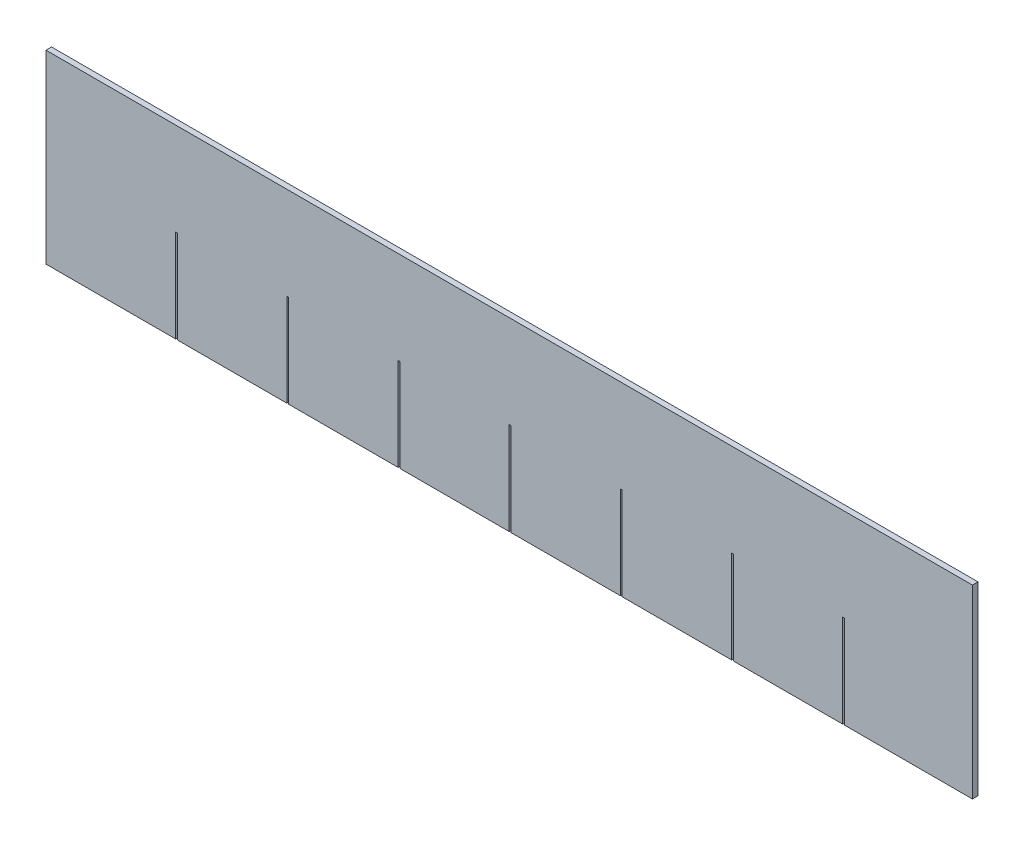
ISO-10303-21;
HEADER;
FILE_DESCRIPTION(('STEP AP214'),'2;1');
FILE_NAME('part.step','',(''),(''),'','','');
FILE_SCHEMA(('AUTOMOTIVE_DESIGN { 1 0 10303 214 1 1 1 1 }'));
ENDSEC;
DATA;
#1=APPLICATION_CONTEXT('core data for automotive mechanical design processes');
#2=APPLICATION_PROTOCOL_DEFINITION('international standard','automotive_design',2000,#1);
#3=PRODUCT_CONTEXT('',#1,'mechanical');
#4=PRODUCT('Part','Part','',(#3));
#5=PRODUCT_RELATED_PRODUCT_CATEGORY('part','',(#4));
#6=PRODUCT_DEFINITION_FORMATION('','',#4);
#7=PRODUCT_DEFINITION_CONTEXT('part definition',#1,'design');
#8=PRODUCT_DEFINITION('design','',#6,#7);
#9=PRODUCT_DEFINITION_SHAPE('','',#8);
#10=(LENGTH_UNIT() NAMED_UNIT(*) SI_UNIT(.MILLI.,.METRE.));
#11=(NAMED_UNIT(*) PLANE_ANGLE_UNIT() SI_UNIT($,.RADIAN.));
#12=(NAMED_UNIT(*) SI_UNIT($,.STERADIAN.) SOLID_ANGLE_UNIT());
#13=UNCERTAINTY_MEASURE_WITH_UNIT(LENGTH_MEASURE(1.E-05),#10,'distance_accuracy_value','');
#14=(GEOMETRIC_REPRESENTATION_CONTEXT(3) GLOBAL_UNCERTAINTY_ASSIGNED_CONTEXT((#13)) GLOBAL_UNIT_ASSIGNED_CONTEXT((#10,
#11,#12)) REPRESENTATION_CONTEXT('',''));
#15=CARTESIAN_POINT('',(0.,0.,0.));
#16=DIRECTION('',(0.,0.,1.));
#17=DIRECTION('',(1.,0.,0.));
#18=AXIS2_PLACEMENT_3D('',#15,#16,#17);
#19=CARTESIAN_POINT('',(-31.75,-6.35,0.381));
#20=DIRECTION('',(0.,1.,0.));
#21=DIRECTION('',(0.,0.,1.));
#22=AXIS2_PLACEMENT_3D('',#19,#20,#21);
#23=PLANE('',#22);
#24=DIRECTION('',(1.,0.,0.));
#25=VECTOR('',#24,1.);
#26=CARTESIAN_POINT('',(-31.75,-6.35,0.));
#27=LINE('',#26,#25);
#28=CARTESIAN_POINT('',(-31.75,-6.35,0.));
#29=VERTEX_POINT('',#28);
#30=CARTESIAN_POINT('',(-22.86,-6.35,0.));
#31=VERTEX_POINT('',#30);
#32=EDGE_CURVE('E258',#29,#31,#27,.T.);
#33=ORIENTED_EDGE('',*,*,#32,.T.);
#34=DIRECTION('',(0.,0.,1.));
#35=VECTOR('',#34,1.);
#36=CARTESIAN_POINT('',(-22.86,-6.35,0.));
#37=LINE('',#36,#35);
#38=CARTESIAN_POINT('',(-22.86,-6.35,0.381));
#39=VERTEX_POINT('',#38);
#40=EDGE_CURVE('E242',#31,#39,#37,.T.);
#41=ORIENTED_EDGE('',*,*,#40,.T.);
#42=DIRECTION('',(1.,0.,0.));
#43=VECTOR('',#42,1.);
#44=CARTESIAN_POINT('',(-31.75,-6.35,0.381));
#45=LINE('',#44,#43);
#46=CARTESIAN_POINT('',(-31.75,-6.35,0.381));
#47=VERTEX_POINT('',#46);
#48=EDGE_CURVE('E295',#47,#39,#45,.T.);
#49=ORIENTED_EDGE('',*,*,#48,.F.);
#50=DIRECTION('',(0.,0.,-1.));
#51=VECTOR('',#50,1.);
#52=CARTESIAN_POINT('',(-31.75,-6.35,0.381));
#53=LINE('',#52,#51);
#54=EDGE_CURVE('E265',#47,#29,#53,.T.);
#55=ORIENTED_EDGE('',*,*,#54,.T.);
#56=EDGE_LOOP('',(#33,#41,#49,#55));
#57=FACE_BOUND('',#56,.T.);
#58=ADVANCED_FACE('F33',(#57),#23,.F.);
#59=CARTESIAN_POINT('',(-22.733,-6.35,0.381));
#60=VERTEX_POINT('',#59);
#61=CARTESIAN_POINT('',(-15.24,-6.35,0.381));
#62=VERTEX_POINT('',#61);
#63=EDGE_CURVE('E298',#60,#62,#45,.T.);
#64=ORIENTED_EDGE('',*,*,#63,.F.);
#65=DIRECTION('',(0.,0.,1.));
#66=VECTOR('',#65,1.);
#67=CARTESIAN_POINT('',(-22.733,-6.35,0.));
#68=LINE('',#67,#66);
#69=CARTESIAN_POINT('',(-22.733,-6.35,0.));
#70=VERTEX_POINT('',#69);
#71=EDGE_CURVE('E252',#70,#60,#68,.T.);
#72=ORIENTED_EDGE('',*,*,#71,.F.);
#73=CARTESIAN_POINT('',(-15.24,-6.35,0.));
#74=VERTEX_POINT('',#73);
#75=EDGE_CURVE('E267',#70,#74,#27,.T.);
#76=ORIENTED_EDGE('',*,*,#75,.T.);
#77=DIRECTION('',(0.,0.,1.));
#78=VECTOR('',#77,1.);
#79=CARTESIAN_POINT('',(-15.24,-6.35,0.));
#80=LINE('',#79,#78);
#81=EDGE_CURVE('E441',#74,#62,#80,.T.);
#82=ORIENTED_EDGE('',*,*,#81,.T.);
#83=EDGE_LOOP('',(#64,#72,#76,#82));
#84=FACE_BOUND('',#83,.T.);
#85=ADVANCED_FACE('F475',(#84),#23,.F.);
#86=CARTESIAN_POINT('',(-15.113,-6.35,0.381));
#87=VERTEX_POINT('',#86);
#88=CARTESIAN_POINT('',(-7.62,-6.35,0.381));
#89=VERTEX_POINT('',#88);
#90=EDGE_CURVE('E479',#87,#89,#45,.T.);
#91=ORIENTED_EDGE('',*,*,#90,.F.);
#92=DIRECTION('',(0.,0.,1.));
#93=VECTOR('',#92,1.);
#94=CARTESIAN_POINT('',(-15.113,-6.35,0.));
#95=LINE('',#94,#93);
#96=CARTESIAN_POINT('',(-15.113,-6.35,0.));
#97=VERTEX_POINT('',#96);
#98=EDGE_CURVE('E434',#97,#87,#95,.T.);
#99=ORIENTED_EDGE('',*,*,#98,.F.);
#100=CARTESIAN_POINT('',(-7.62,-6.35,0.));
#101=VERTEX_POINT('',#100);
#102=EDGE_CURVE('E274',#97,#101,#27,.T.);
#103=ORIENTED_EDGE('',*,*,#102,.T.);
#104=DIRECTION('',(0.,0.,1.));
#105=VECTOR('',#104,1.);
#106=CARTESIAN_POINT('',(-7.62,-6.35,0.));
#107=LINE('',#106,#105);
#108=EDGE_CURVE('E415',#101,#89,#107,.T.);
#109=ORIENTED_EDGE('',*,*,#108,.T.);
#110=EDGE_LOOP('',(#91,#99,#103,#109));
#111=FACE_BOUND('',#110,.T.);
#112=ADVANCED_FACE('F558',(#111),#23,.F.);
#113=CARTESIAN_POINT('',(-7.493,-6.35,0.381));
#114=VERTEX_POINT('',#113);
#115=CARTESIAN_POINT('',(0.,-6.35,0.381));
#116=VERTEX_POINT('',#115);
#117=EDGE_CURVE('E481',#114,#116,#45,.T.);
#118=ORIENTED_EDGE('',*,*,#117,.F.);
#119=DIRECTION('',(0.,0.,1.));
#120=VECTOR('',#119,1.);
#121=CARTESIAN_POINT('',(-7.493,-6.35,0.));
#122=LINE('',#121,#120);
#123=CARTESIAN_POINT('',(-7.493,-6.35,0.));
#124=VERTEX_POINT('',#123);
#125=EDGE_CURVE('E408',#124,#114,#122,.T.);
#126=ORIENTED_EDGE('',*,*,#125,.F.);
#127=CARTESIAN_POINT('',(0.,-6.35,0.));
#128=VERTEX_POINT('',#127);
#129=EDGE_CURVE('E546',#124,#128,#27,.T.);
#130=ORIENTED_EDGE('',*,*,#129,.T.);
#131=DIRECTION('',(0.,0.,1.));
#132=VECTOR('',#131,1.);
#133=CARTESIAN_POINT('',(0.,-6.35,0.));
#134=LINE('',#133,#132);
#135=EDGE_CURVE('E389',#128,#116,#134,.T.);
#136=ORIENTED_EDGE('',*,*,#135,.T.);
#137=EDGE_LOOP('',(#118,#126,#130,#136));
#138=FACE_BOUND('',#137,.T.);
#139=ADVANCED_FACE('F568',(#138),#23,.F.);
#140=CARTESIAN_POINT('',(0.126999999999995,-6.35,0.381));
#141=VERTEX_POINT('',#140);
#142=CARTESIAN_POINT('',(7.61999999999999,-6.35,0.381));
#143=VERTEX_POINT('',#142);
#144=EDGE_CURVE('E486',#141,#143,#45,.T.);
#145=ORIENTED_EDGE('',*,*,#144,.F.);
#146=DIRECTION('',(0.,0.,1.));
#147=VECTOR('',#146,1.);
#148=CARTESIAN_POINT('',(0.126999999999995,-6.35,0.));
#149=LINE('',#148,#147);
#150=CARTESIAN_POINT('',(0.126999999999995,-6.35,0.));
#151=VERTEX_POINT('',#150);
#152=EDGE_CURVE('E382',#151,#141,#149,.T.);
#153=ORIENTED_EDGE('',*,*,#152,.F.);
#154=CARTESIAN_POINT('',(7.61999999999999,-6.35,0.));
#155=VERTEX_POINT('',#154);
#156=EDGE_CURVE('E544',#151,#155,#27,.T.);
#157=ORIENTED_EDGE('',*,*,#156,.T.);
#158=DIRECTION('',(0.,0.,1.));
#159=VECTOR('',#158,1.);
#160=CARTESIAN_POINT('',(7.61999999999999,-6.35,0.));
#161=LINE('',#160,#159);
#162=EDGE_CURVE('E363',#155,#143,#161,.T.);
#163=ORIENTED_EDGE('',*,*,#162,.T.);
#164=EDGE_LOOP('',(#145,#153,#157,#163));
#165=FACE_BOUND('',#164,.T.);
#166=ADVANCED_FACE('F578',(#165),#23,.F.);
#167=CARTESIAN_POINT('',(7.74699999999999,-6.35,0.381));
#168=VERTEX_POINT('',#167);
#169=CARTESIAN_POINT('',(15.24,-6.35,0.381));
#170=VERTEX_POINT('',#169);
#171=EDGE_CURVE('E491',#168,#170,#45,.T.);
#172=ORIENTED_EDGE('',*,*,#171,.F.);
#173=DIRECTION('',(0.,0.,1.));
#174=VECTOR('',#173,1.);
#175=CARTESIAN_POINT('',(7.74699999999999,-6.35,0.));
#176=LINE('',#175,#174);
#177=CARTESIAN_POINT('',(7.74699999999999,-6.35,0.));
#178=VERTEX_POINT('',#177);
#179=EDGE_CURVE('E356',#178,#168,#176,.T.);
#180=ORIENTED_EDGE('',*,*,#179,.F.);
#181=CARTESIAN_POINT('',(15.24,-6.35,0.));
#182=VERTEX_POINT('',#181);
#183=EDGE_CURVE('E285',#178,#182,#27,.T.);
#184=ORIENTED_EDGE('',*,*,#183,.T.);
#185=DIRECTION('',(0.,0.,1.));
#186=VECTOR('',#185,1.);
#187=CARTESIAN_POINT('',(15.24,-6.35,0.));
#188=LINE('',#187,#186);
#189=EDGE_CURVE('E337',#182,#170,#188,.T.);
#190=ORIENTED_EDGE('',*,*,#189,.T.);
#191=EDGE_LOOP('',(#172,#180,#184,#190));
#192=FACE_BOUND('',#191,.T.);
#193=ADVANCED_FACE('F543',(#192),#23,.F.);
#194=CARTESIAN_POINT('',(15.367,-6.35,0.381));
#195=VERTEX_POINT('',#194);
#196=CARTESIAN_POINT('',(22.86,-6.35,0.381));
#197=VERTEX_POINT('',#196);
#198=EDGE_CURVE('E496',#195,#197,#45,.T.);
#199=ORIENTED_EDGE('',*,*,#198,.F.);
#200=DIRECTION('',(0.,0.,1.));
#201=VECTOR('',#200,1.);
#202=CARTESIAN_POINT('',(15.367,-6.35,0.));
#203=LINE('',#202,#201);
#204=CARTESIAN_POINT('',(15.367,-6.35,0.));
#205=VERTEX_POINT('',#204);
#206=EDGE_CURVE('E330',#205,#195,#203,.T.);
#207=ORIENTED_EDGE('',*,*,#206,.F.);
#208=CARTESIAN_POINT('',(22.86,-6.35,0.));
#209=VERTEX_POINT('',#208);
#210=EDGE_CURVE('E277',#205,#209,#27,.T.);
#211=ORIENTED_EDGE('',*,*,#210,.T.);
#212=DIRECTION('',(0.,0.,1.));
#213=VECTOR('',#212,1.);
#214=CARTESIAN_POINT('',(22.86,-6.35,0.));
#215=LINE('',#214,#213);
#216=EDGE_CURVE('E310',#209,#197,#215,.T.);
#217=ORIENTED_EDGE('',*,*,#216,.T.);
#218=EDGE_LOOP('',(#199,#207,#211,#217));
#219=FACE_BOUND('',#218,.T.);
#220=ADVANCED_FACE('F530',(#219),#23,.F.);
#221=CARTESIAN_POINT('',(31.75,6.35,0.381));
#222=DIRECTION('',(-1.,0.,0.));
#223=DIRECTION('',(0.,0.,1.));
#224=AXIS2_PLACEMENT_3D('',#221,#222,#223);
#225=PLANE('',#224);
#226=DIRECTION('',(0.,1.,0.));
#227=VECTOR('',#226,1.);
#228=CARTESIAN_POINT('',(31.75,6.35,0.));
#229=LINE('',#228,#227);
#230=CARTESIAN_POINT('',(31.75,-6.35,0.));
#231=VERTEX_POINT('',#230);
#232=CARTESIAN_POINT('',(31.75,6.35,0.));
#233=VERTEX_POINT('',#232);
#234=EDGE_CURVE('E289',#231,#233,#229,.T.);
#235=ORIENTED_EDGE('',*,*,#234,.T.);
#236=DIRECTION('',(0.,0.,-1.));
#237=VECTOR('',#236,1.);
#238=CARTESIAN_POINT('',(31.75,6.35,0.381));
#239=LINE('',#238,#237);
#240=CARTESIAN_POINT('',(31.75,6.35,0.381));
#241=VERTEX_POINT('',#240);
#242=EDGE_CURVE('E11',#241,#233,#239,.T.);
#243=ORIENTED_EDGE('',*,*,#242,.F.);
#244=DIRECTION('',(0.,1.,0.));
#245=VECTOR('',#244,1.);
#246=CARTESIAN_POINT('',(31.75,6.35,0.381));
#247=LINE('',#246,#245);
#248=CARTESIAN_POINT('',(31.75,-6.35,0.381));
#249=VERTEX_POINT('',#248);
#250=EDGE_CURVE('E266',#249,#241,#247,.T.);
#251=ORIENTED_EDGE('',*,*,#250,.F.);
#252=DIRECTION('',(0.,0.,-1.));
#253=VECTOR('',#252,1.);
#254=CARTESIAN_POINT('',(31.75,-6.35,0.381));
#255=LINE('',#254,#253);
#256=EDGE_CURVE('E297',#249,#231,#255,.T.);
#257=ORIENTED_EDGE('',*,*,#256,.T.);
#258=EDGE_LOOP('',(#235,#243,#251,#257));
#259=FACE_BOUND('',#258,.T.);
#260=ADVANCED_FACE('F35',(#259),#225,.F.);
#261=CARTESIAN_POINT('',(-31.75,6.35,0.381));
#262=DIRECTION('',(0.,-1.,0.));
#263=DIRECTION('',(0.,0.,-1.));
#264=AXIS2_PLACEMENT_3D('',#261,#262,#263);
#265=PLANE('',#264);
#266=DIRECTION('',(-1.,0.,0.));
#267=VECTOR('',#266,1.);
#268=CARTESIAN_POINT('',(-31.75,6.35,0.));
#269=LINE('',#268,#267);
#270=CARTESIAN_POINT('',(-31.75,6.35,0.));
#271=VERTEX_POINT('',#270);
#272=EDGE_CURVE('E286',#233,#271,#269,.T.);
#273=ORIENTED_EDGE('',*,*,#272,.T.);
#274=DIRECTION('',(0.,0.,-1.));
#275=VECTOR('',#274,1.);
#276=CARTESIAN_POINT('',(-31.75,6.35,0.381));
#277=LINE('',#276,#275);
#278=CARTESIAN_POINT('',(-31.75,6.35,0.381));
#279=VERTEX_POINT('',#278);
#280=EDGE_CURVE('E41',#279,#271,#277,.T.);
#281=ORIENTED_EDGE('',*,*,#280,.F.);
#282=DIRECTION('',(-1.,0.,0.));
#283=VECTOR('',#282,1.);
#284=CARTESIAN_POINT('',(-31.75,6.35,0.381));
#285=LINE('',#284,#283);
#286=EDGE_CURVE('E271',#241,#279,#285,.T.);
#287=ORIENTED_EDGE('',*,*,#286,.F.);
#288=ORIENTED_EDGE('',*,*,#242,.T.);
#289=EDGE_LOOP('',(#273,#281,#287,#288));
#290=FACE_BOUND('',#289,.T.);
#291=ADVANCED_FACE('F514',(#290),#265,.F.);
#292=CARTESIAN_POINT('',(-31.75,6.35,0.381));
#293=DIRECTION('',(1.,0.,0.));
#294=DIRECTION('',(0.,0.,-1.));
#295=AXIS2_PLACEMENT_3D('',#292,#293,#294);
#296=PLANE('',#295);
#297=DIRECTION('',(0.,-1.,0.));
#298=VECTOR('',#297,1.);
#299=CARTESIAN_POINT('',(-31.75,6.35,0.));
#300=LINE('',#299,#298);
#301=EDGE_CURVE('E278',#271,#29,#300,.T.);
#302=ORIENTED_EDGE('',*,*,#301,.T.);
#303=ORIENTED_EDGE('',*,*,#54,.F.);
#304=DIRECTION('',(0.,-1.,0.));
#305=VECTOR('',#304,1.);
#306=CARTESIAN_POINT('',(-31.75,6.35,0.381));
#307=LINE('',#306,#305);
#308=EDGE_CURVE('E300',#279,#47,#307,.T.);
#309=ORIENTED_EDGE('',*,*,#308,.F.);
#310=ORIENTED_EDGE('',*,*,#280,.T.);
#311=EDGE_LOOP('',(#302,#303,#309,#310));
#312=FACE_BOUND('',#311,.T.);
#313=ADVANCED_FACE('F517',(#312),#296,.F.);
#314=CARTESIAN_POINT('',(22.987,-6.35,0.381));
#315=VERTEX_POINT('',#314);
#316=EDGE_CURVE('E299',#315,#249,#45,.T.);
#317=ORIENTED_EDGE('',*,*,#316,.F.);
#318=DIRECTION('',(0.,0.,1.));
#319=VECTOR('',#318,1.);
#320=CARTESIAN_POINT('',(22.987,-6.35,0.));
#321=LINE('',#320,#319);
#322=CARTESIAN_POINT('',(22.987,-6.35,0.));
#323=VERTEX_POINT('',#322);
#324=EDGE_CURVE('E303',#323,#315,#321,.T.);
#325=ORIENTED_EDGE('',*,*,#324,.F.);
#326=EDGE_CURVE('E269',#323,#231,#27,.T.);
#327=ORIENTED_EDGE('',*,*,#326,.T.);
#328=ORIENTED_EDGE('',*,*,#256,.F.);
#329=EDGE_LOOP('',(#317,#325,#327,#328));
#330=FACE_BOUND('',#329,.T.);
#331=ADVANCED_FACE('F510',(#330),#23,.F.);
#332=CARTESIAN_POINT('',(0.,0.,0.381));
#333=DIRECTION('',(0.,0.,1.));
#334=DIRECTION('',(1.,0.,0.));
#335=AXIS2_PLACEMENT_3D('',#332,#333,#334);
#336=PLANE('',#335);
#337=DIRECTION('',(0.,-1.,0.));
#338=VECTOR('',#337,1.);
#339=CARTESIAN_POINT('',(-22.86,-6.35,0.381));
#340=LINE('',#339,#338);
#341=CARTESIAN_POINT('',(-22.86,0.,0.381));
#342=VERTEX_POINT('',#341);
#343=EDGE_CURVE('E247',#342,#39,#340,.T.);
#344=ORIENTED_EDGE('',*,*,#343,.F.);
#345=DIRECTION('',(-1.,0.,0.));
#346=VECTOR('',#345,1.);
#347=CARTESIAN_POINT('',(-22.86,0.,0.381));
#348=LINE('',#347,#346);
#349=CARTESIAN_POINT('',(-22.733,0.,0.381));
#350=VERTEX_POINT('',#349);
#351=EDGE_CURVE('E261',#350,#342,#348,.T.);
#352=ORIENTED_EDGE('',*,*,#351,.F.);
#353=DIRECTION('',(0.,1.,0.));
#354=VECTOR('',#353,1.);
#355=CARTESIAN_POINT('',(-22.733,-6.35,0.381));
#356=LINE('',#355,#354);
#357=EDGE_CURVE('E463',#60,#350,#356,.T.);
#358=ORIENTED_EDGE('',*,*,#357,.F.);
#359=ORIENTED_EDGE('',*,*,#63,.T.);
#360=DIRECTION('',(0.,-1.,0.));
#361=VECTOR('',#360,1.);
#362=CARTESIAN_POINT('',(-15.24,-6.35,0.381));
#363=LINE('',#362,#361);
#364=CARTESIAN_POINT('',(-15.24,0.,0.381));
#365=VERTEX_POINT('',#364);
#366=EDGE_CURVE('E444',#365,#62,#363,.T.);
#367=ORIENTED_EDGE('',*,*,#366,.F.);
#368=DIRECTION('',(-1.,0.,0.));
#369=VECTOR('',#368,1.);
#370=CARTESIAN_POINT('',(-15.24,0.,0.381));
#371=LINE('',#370,#369);
#372=CARTESIAN_POINT('',(-15.113,0.,0.381));
#373=VERTEX_POINT('',#372);
#374=EDGE_CURVE('E447',#373,#365,#371,.T.);
#375=ORIENTED_EDGE('',*,*,#374,.F.);
#376=DIRECTION('',(0.,1.,0.));
#377=VECTOR('',#376,1.);
#378=CARTESIAN_POINT('',(-15.113,-6.35,0.381));
#379=LINE('',#378,#377);
#380=EDGE_CURVE('E418',#87,#373,#379,.T.);
#381=ORIENTED_EDGE('',*,*,#380,.F.);
#382=ORIENTED_EDGE('',*,*,#90,.T.);
#383=DIRECTION('',(0.,-1.,0.));
#384=VECTOR('',#383,1.);
#385=CARTESIAN_POINT('',(-7.62,-6.35,0.381));
#386=LINE('',#385,#384);
#387=CARTESIAN_POINT('',(-7.62,0.,0.381));
#388=VERTEX_POINT('',#387);
#389=EDGE_CURVE('E419',#388,#89,#386,.T.);
#390=ORIENTED_EDGE('',*,*,#389,.F.);
#391=DIRECTION('',(-1.,0.,0.));
#392=VECTOR('',#391,1.);
#393=CARTESIAN_POINT('',(-7.62,0.,0.381));
#394=LINE('',#393,#392);
#395=CARTESIAN_POINT('',(-7.493,0.,0.381));
#396=VERTEX_POINT('',#395);
#397=EDGE_CURVE('E422',#396,#388,#394,.T.);
#398=ORIENTED_EDGE('',*,*,#397,.F.);
#399=DIRECTION('',(0.,1.,0.));
#400=VECTOR('',#399,1.);
#401=CARTESIAN_POINT('',(-7.493,-6.35,0.381));
#402=LINE('',#401,#400);
#403=EDGE_CURVE('E392',#114,#396,#402,.T.);
#404=ORIENTED_EDGE('',*,*,#403,.F.);
#405=ORIENTED_EDGE('',*,*,#117,.T.);
#406=DIRECTION('',(0.,-1.,0.));
#407=VECTOR('',#406,1.);
#408=CARTESIAN_POINT('',(0.,-6.35,0.381));
#409=LINE('',#408,#407);
#410=CARTESIAN_POINT('',(0.,0.,0.381));
#411=VERTEX_POINT('',#410);
#412=EDGE_CURVE('E393',#411,#116,#409,.T.);
#413=ORIENTED_EDGE('',*,*,#412,.F.);
#414=DIRECTION('',(-1.,0.,0.));
#415=VECTOR('',#414,1.);
#416=CARTESIAN_POINT('',(0.,0.,0.381));
#417=LINE('',#416,#415);
#418=CARTESIAN_POINT('',(0.126999999999995,0.,0.381));
#419=VERTEX_POINT('',#418);
#420=EDGE_CURVE('E396',#419,#411,#417,.T.);
#421=ORIENTED_EDGE('',*,*,#420,.F.);
#422=DIRECTION('',(0.,1.,0.));
#423=VECTOR('',#422,1.);
#424=CARTESIAN_POINT('',(0.126999999999995,-6.35,0.381));
#425=LINE('',#424,#423);
#426=EDGE_CURVE('E366',#141,#419,#425,.T.);
#427=ORIENTED_EDGE('',*,*,#426,.F.);
#428=ORIENTED_EDGE('',*,*,#144,.T.);
#429=DIRECTION('',(0.,-1.,0.));
#430=VECTOR('',#429,1.);
#431=CARTESIAN_POINT('',(7.61999999999999,-6.35,0.381));
#432=LINE('',#431,#430);
#433=CARTESIAN_POINT('',(7.61999999999999,0.,0.381));
#434=VERTEX_POINT('',#433);
#435=EDGE_CURVE('E367',#434,#143,#432,.T.);
#436=ORIENTED_EDGE('',*,*,#435,.F.);
#437=DIRECTION('',(-1.,0.,0.));
#438=VECTOR('',#437,1.);
#439=CARTESIAN_POINT('',(7.61999999999999,0.,0.381));
#440=LINE('',#439,#438);
#441=CARTESIAN_POINT('',(7.74699999999999,0.,0.381));
#442=VERTEX_POINT('',#441);
#443=EDGE_CURVE('E370',#442,#434,#440,.T.);
#444=ORIENTED_EDGE('',*,*,#443,.F.);
#445=DIRECTION('',(0.,1.,0.));
#446=VECTOR('',#445,1.);
#447=CARTESIAN_POINT('',(7.74699999999999,-6.35,0.381));
#448=LINE('',#447,#446);
#449=EDGE_CURVE('E340',#168,#442,#448,.T.);
#450=ORIENTED_EDGE('',*,*,#449,.F.);
#451=ORIENTED_EDGE('',*,*,#171,.T.);
#452=DIRECTION('',(0.,-1.,0.));
#453=VECTOR('',#452,1.);
#454=CARTESIAN_POINT('',(15.24,-6.35,0.381));
#455=LINE('',#454,#453);
#456=CARTESIAN_POINT('',(15.24,0.,0.381));
#457=VERTEX_POINT('',#456);
#458=EDGE_CURVE('E341',#457,#170,#455,.T.);
#459=ORIENTED_EDGE('',*,*,#458,.F.);
#460=DIRECTION('',(-1.,0.,0.));
#461=VECTOR('',#460,1.);
#462=CARTESIAN_POINT('',(15.24,0.,0.381));
#463=LINE('',#462,#461);
#464=CARTESIAN_POINT('',(15.367,0.,0.381));
#465=VERTEX_POINT('',#464);
#466=EDGE_CURVE('E344',#465,#457,#463,.T.);
#467=ORIENTED_EDGE('',*,*,#466,.F.);
#468=DIRECTION('',(0.,1.,0.));
#469=VECTOR('',#468,1.);
#470=CARTESIAN_POINT('',(15.367,-6.35,0.381));
#471=LINE('',#470,#469);
#472=EDGE_CURVE('E313',#195,#465,#471,.T.);
#473=ORIENTED_EDGE('',*,*,#472,.F.);
#474=ORIENTED_EDGE('',*,*,#198,.T.);
#475=DIRECTION('',(0.,-1.,0.));
#476=VECTOR('',#475,1.);
#477=CARTESIAN_POINT('',(22.86,-6.35,0.381));
#478=LINE('',#477,#476);
#479=CARTESIAN_POINT('',(22.86,0.,0.381));
#480=VERTEX_POINT('',#479);
#481=EDGE_CURVE('E314',#480,#197,#478,.T.);
#482=ORIENTED_EDGE('',*,*,#481,.F.);
#483=DIRECTION('',(-1.,0.,0.));
#484=VECTOR('',#483,1.);
#485=CARTESIAN_POINT('',(22.86,0.,0.381));
#486=LINE('',#485,#484);
#487=CARTESIAN_POINT('',(22.987,0.,0.381));
#488=VERTEX_POINT('',#487);
#489=EDGE_CURVE('E317',#488,#480,#486,.T.);
#490=ORIENTED_EDGE('',*,*,#489,.F.);
#491=DIRECTION('',(0.,1.,0.));
#492=VECTOR('',#491,1.);
#493=CARTESIAN_POINT('',(22.987,-6.35,0.381));
#494=LINE('',#493,#492);
#495=EDGE_CURVE('E320',#315,#488,#494,.T.);
#496=ORIENTED_EDGE('',*,*,#495,.F.);
#497=ORIENTED_EDGE('',*,*,#316,.T.);
#498=ORIENTED_EDGE('',*,*,#250,.T.);
#499=ORIENTED_EDGE('',*,*,#286,.T.);
#500=ORIENTED_EDGE('',*,*,#308,.T.);
#501=ORIENTED_EDGE('',*,*,#48,.T.);
#502=EDGE_LOOP('',(#344,#352,#358,#359,#367,#375,#381,#382,#390,#398,#404,#405,#413,#421,#427,
#428,#436,#444,#450,#451,#459,#467,#473,#474,#482,#490,#496,#497,#498,#499,#500,#501));
#503=FACE_BOUND('',#502,.T.);
#504=ADVANCED_FACE('F506',(#503),#336,.T.);
#505=CARTESIAN_POINT('',(0.,0.,0.));
#506=DIRECTION('',(0.,0.,1.));
#507=DIRECTION('',(1.,0.,0.));
#508=AXIS2_PLACEMENT_3D('',#505,#506,#507);
#509=PLANE('',#508);
#510=DIRECTION('',(-1.,0.,0.));
#511=VECTOR('',#510,1.);
#512=CARTESIAN_POINT('',(-22.86,0.,0.));
#513=LINE('',#512,#511);
#514=CARTESIAN_POINT('',(-22.733,0.,0.));
#515=VERTEX_POINT('',#514);
#516=CARTESIAN_POINT('',(-22.86,0.,0.));
#517=VERTEX_POINT('',#516);
#518=EDGE_CURVE('E48',#515,#517,#513,.T.);
#519=ORIENTED_EDGE('',*,*,#518,.T.);
#520=DIRECTION('',(0.,-1.,0.));
#521=VECTOR('',#520,1.);
#522=CARTESIAN_POINT('',(-22.86,-6.35,0.));
#523=LINE('',#522,#521);
#524=EDGE_CURVE('E245',#517,#31,#523,.T.);
#525=ORIENTED_EDGE('',*,*,#524,.T.);
#526=ORIENTED_EDGE('',*,*,#32,.F.);
#527=ORIENTED_EDGE('',*,*,#301,.F.);
#528=ORIENTED_EDGE('',*,*,#272,.F.);
#529=ORIENTED_EDGE('',*,*,#234,.F.);
#530=ORIENTED_EDGE('',*,*,#326,.F.);
#531=DIRECTION('',(0.,1.,0.));
#532=VECTOR('',#531,1.);
#533=CARTESIAN_POINT('',(22.987,-6.35,0.));
#534=LINE('',#533,#532);
#535=CARTESIAN_POINT('',(22.987,0.,0.));
#536=VERTEX_POINT('',#535);
#537=EDGE_CURVE('E316',#323,#536,#534,.T.);
#538=ORIENTED_EDGE('',*,*,#537,.T.);
#539=DIRECTION('',(-1.,0.,0.));
#540=VECTOR('',#539,1.);
#541=CARTESIAN_POINT('',(22.86,0.,0.));
#542=LINE('',#541,#540);
#543=CARTESIAN_POINT('',(22.86,0.,0.));
#544=VERTEX_POINT('',#543);
#545=EDGE_CURVE('E325',#536,#544,#542,.T.);
#546=ORIENTED_EDGE('',*,*,#545,.T.);
#547=DIRECTION('',(0.,-1.,0.));
#548=VECTOR('',#547,1.);
#549=CARTESIAN_POINT('',(22.86,-6.35,0.));
#550=LINE('',#549,#548);
#551=EDGE_CURVE('E306',#544,#209,#550,.T.);
#552=ORIENTED_EDGE('',*,*,#551,.T.);
#553=ORIENTED_EDGE('',*,*,#210,.F.);
#554=DIRECTION('',(0.,1.,0.));
#555=VECTOR('',#554,1.);
#556=CARTESIAN_POINT('',(15.367,-6.35,0.));
#557=LINE('',#556,#555);
#558=CARTESIAN_POINT('',(15.367,0.,0.));
#559=VERTEX_POINT('',#558);
#560=EDGE_CURVE('E343',#205,#559,#557,.T.);
#561=ORIENTED_EDGE('',*,*,#560,.T.);
#562=DIRECTION('',(-1.,0.,0.));
#563=VECTOR('',#562,1.);
#564=CARTESIAN_POINT('',(15.24,0.,0.));
#565=LINE('',#564,#563);
#566=CARTESIAN_POINT('',(15.24,0.,0.));
#567=VERTEX_POINT('',#566);
#568=EDGE_CURVE('E351',#559,#567,#565,.T.);
#569=ORIENTED_EDGE('',*,*,#568,.T.);
#570=DIRECTION('',(0.,-1.,0.));
#571=VECTOR('',#570,1.);
#572=CARTESIAN_POINT('',(15.24,-6.35,0.));
#573=LINE('',#572,#571);
#574=EDGE_CURVE('E333',#567,#182,#573,.T.);
#575=ORIENTED_EDGE('',*,*,#574,.T.);
#576=ORIENTED_EDGE('',*,*,#183,.F.);
#577=DIRECTION('',(0.,1.,0.));
#578=VECTOR('',#577,1.);
#579=CARTESIAN_POINT('',(7.74699999999999,-6.35,0.));
#580=LINE('',#579,#578);
#581=CARTESIAN_POINT('',(7.74699999999999,0.,0.));
#582=VERTEX_POINT('',#581);
#583=EDGE_CURVE('E369',#178,#582,#580,.T.);
#584=ORIENTED_EDGE('',*,*,#583,.T.);
#585=DIRECTION('',(-1.,0.,0.));
#586=VECTOR('',#585,1.);
#587=CARTESIAN_POINT('',(7.61999999999999,0.,0.));
#588=LINE('',#587,#586);
#589=CARTESIAN_POINT('',(7.61999999999999,0.,0.));
#590=VERTEX_POINT('',#589);
#591=EDGE_CURVE('E377',#582,#590,#588,.T.);
#592=ORIENTED_EDGE('',*,*,#591,.T.);
#593=DIRECTION('',(0.,-1.,0.));
#594=VECTOR('',#593,1.);
#595=CARTESIAN_POINT('',(7.61999999999999,-6.35,0.));
#596=LINE('',#595,#594);
#597=EDGE_CURVE('E359',#590,#155,#596,.T.);
#598=ORIENTED_EDGE('',*,*,#597,.T.);
#599=ORIENTED_EDGE('',*,*,#156,.F.);
#600=DIRECTION('',(0.,1.,0.));
#601=VECTOR('',#600,1.);
#602=CARTESIAN_POINT('',(0.126999999999995,-6.35,0.));
#603=LINE('',#602,#601);
#604=CARTESIAN_POINT('',(0.126999999999995,0.,0.));
#605=VERTEX_POINT('',#604);
#606=EDGE_CURVE('E395',#151,#605,#603,.T.);
#607=ORIENTED_EDGE('',*,*,#606,.T.);
#608=DIRECTION('',(-1.,0.,0.));
#609=VECTOR('',#608,1.);
#610=CARTESIAN_POINT('',(0.,0.,0.));
#611=LINE('',#610,#609);
#612=CARTESIAN_POINT('',(0.,0.,0.));
#613=VERTEX_POINT('',#612);
#614=EDGE_CURVE('E403',#605,#613,#611,.T.);
#615=ORIENTED_EDGE('',*,*,#614,.T.);
#616=DIRECTION('',(0.,-1.,0.));
#617=VECTOR('',#616,1.);
#618=CARTESIAN_POINT('',(0.,-6.35,0.));
#619=LINE('',#618,#617);
#620=EDGE_CURVE('E385',#613,#128,#619,.T.);
#621=ORIENTED_EDGE('',*,*,#620,.T.);
#622=ORIENTED_EDGE('',*,*,#129,.F.);
#623=DIRECTION('',(0.,1.,0.));
#624=VECTOR('',#623,1.);
#625=CARTESIAN_POINT('',(-7.493,-6.35,0.));
#626=LINE('',#625,#624);
#627=CARTESIAN_POINT('',(-7.493,0.,0.));
#628=VERTEX_POINT('',#627);
#629=EDGE_CURVE('E421',#124,#628,#626,.T.);
#630=ORIENTED_EDGE('',*,*,#629,.T.);
#631=DIRECTION('',(-1.,0.,0.));
#632=VECTOR('',#631,1.);
#633=CARTESIAN_POINT('',(-7.62,0.,0.));
#634=LINE('',#633,#632);
#635=CARTESIAN_POINT('',(-7.62,0.,0.));
#636=VERTEX_POINT('',#635);
#637=EDGE_CURVE('E429',#628,#636,#634,.T.);
#638=ORIENTED_EDGE('',*,*,#637,.T.);
#639=DIRECTION('',(0.,-1.,0.));
#640=VECTOR('',#639,1.);
#641=CARTESIAN_POINT('',(-7.62,-6.35,0.));
#642=LINE('',#641,#640);
#643=EDGE_CURVE('E411',#636,#101,#642,.T.);
#644=ORIENTED_EDGE('',*,*,#643,.T.);
#645=ORIENTED_EDGE('',*,*,#102,.F.);
#646=DIRECTION('',(0.,1.,0.));
#647=VECTOR('',#646,1.);
#648=CARTESIAN_POINT('',(-15.113,-6.35,0.));
#649=LINE('',#648,#647);
#650=CARTESIAN_POINT('',(-15.113,0.,0.));
#651=VERTEX_POINT('',#650);
#652=EDGE_CURVE('E446',#97,#651,#649,.T.);
#653=ORIENTED_EDGE('',*,*,#652,.T.);
#654=DIRECTION('',(-1.,0.,0.));
#655=VECTOR('',#654,1.);
#656=CARTESIAN_POINT('',(-15.24,0.,0.));
#657=LINE('',#656,#655);
#658=CARTESIAN_POINT('',(-15.24,0.,0.));
#659=VERTEX_POINT('',#658);
#660=EDGE_CURVE('E56',#651,#659,#657,.T.);
#661=ORIENTED_EDGE('',*,*,#660,.T.);
#662=DIRECTION('',(0.,-1.,0.));
#663=VECTOR('',#662,1.);
#664=CARTESIAN_POINT('',(-15.24,-6.35,0.));
#665=LINE('',#664,#663);
#666=EDGE_CURVE('E437',#659,#74,#665,.T.);
#667=ORIENTED_EDGE('',*,*,#666,.T.);
#668=ORIENTED_EDGE('',*,*,#75,.F.);
#669=DIRECTION('',(0.,1.,0.));
#670=VECTOR('',#669,1.);
#671=CARTESIAN_POINT('',(-22.733,-6.35,0.));
#672=LINE('',#671,#670);
#673=EDGE_CURVE('E260',#70,#515,#672,.T.);
#674=ORIENTED_EDGE('',*,*,#673,.T.);
#675=EDGE_LOOP('',(#519,#525,#526,#527,#528,#529,#530,#538,#546,#552,#553,#561,#569,#575,#576,
#584,#592,#598,#599,#607,#615,#621,#622,#630,#638,#644,#645,#653,#661,#667,#668,#674));
#676=FACE_BOUND('',#675,.T.);
#677=ADVANCED_FACE('F256',(#676),#509,.F.);
#678=CARTESIAN_POINT('',(22.86,-6.35,0.));
#679=DIRECTION('',(-1.,0.,0.));
#680=DIRECTION('',(0.,0.,1.));
#681=AXIS2_PLACEMENT_3D('',#678,#679,#680);
#682=PLANE('',#681);
#683=ORIENTED_EDGE('',*,*,#481,.T.);
#684=ORIENTED_EDGE('',*,*,#216,.F.);
#685=ORIENTED_EDGE('',*,*,#551,.F.);
#686=DIRECTION('',(0.,0.,1.));
#687=VECTOR('',#686,1.);
#688=CARTESIAN_POINT('',(22.86,0.,0.));
#689=LINE('',#688,#687);
#690=EDGE_CURVE('E308',#544,#480,#689,.T.);
#691=ORIENTED_EDGE('',*,*,#690,.T.);
#692=EDGE_LOOP('',(#683,#684,#685,#691));
#693=FACE_BOUND('',#692,.T.);
#694=ADVANCED_FACE('F526',(#693),#682,.F.);
#695=CARTESIAN_POINT('',(22.86,0.,0.));
#696=DIRECTION('',(0.,1.,0.));
#697=DIRECTION('',(0.,0.,1.));
#698=AXIS2_PLACEMENT_3D('',#695,#696,#697);
#699=PLANE('',#698);
#700=ORIENTED_EDGE('',*,*,#489,.T.);
#701=ORIENTED_EDGE('',*,*,#690,.F.);
#702=ORIENTED_EDGE('',*,*,#545,.F.);
#703=DIRECTION('',(0.,0.,1.));
#704=VECTOR('',#703,1.);
#705=CARTESIAN_POINT('',(22.987,0.,0.));
#706=LINE('',#705,#704);
#707=EDGE_CURVE('E305',#536,#488,#706,.T.);
#708=ORIENTED_EDGE('',*,*,#707,.T.);
#709=EDGE_LOOP('',(#700,#701,#702,#708));
#710=FACE_BOUND('',#709,.T.);
#711=ADVANCED_FACE('F523',(#710),#699,.F.);
#712=CARTESIAN_POINT('',(22.987,-6.35,0.));
#713=DIRECTION('',(1.,0.,0.));
#714=DIRECTION('',(0.,0.,-1.));
#715=AXIS2_PLACEMENT_3D('',#712,#713,#714);
#716=PLANE('',#715);
#717=ORIENTED_EDGE('',*,*,#495,.T.);
#718=ORIENTED_EDGE('',*,*,#707,.F.);
#719=ORIENTED_EDGE('',*,*,#537,.F.);
#720=ORIENTED_EDGE('',*,*,#324,.T.);
#721=EDGE_LOOP('',(#717,#718,#719,#720));
#722=FACE_BOUND('',#721,.T.);
#723=ADVANCED_FACE('F521',(#722),#716,.F.);
#724=CARTESIAN_POINT('',(15.24,-6.35,0.));
#725=DIRECTION('',(-1.,0.,0.));
#726=DIRECTION('',(0.,0.,1.));
#727=AXIS2_PLACEMENT_3D('',#724,#725,#726);
#728=PLANE('',#727);
#729=ORIENTED_EDGE('',*,*,#458,.T.);
#730=ORIENTED_EDGE('',*,*,#189,.F.);
#731=ORIENTED_EDGE('',*,*,#574,.F.);
#732=DIRECTION('',(0.,0.,1.));
#733=VECTOR('',#732,1.);
#734=CARTESIAN_POINT('',(15.24,0.,0.));
#735=LINE('',#734,#733);
#736=EDGE_CURVE('E335',#567,#457,#735,.T.);
#737=ORIENTED_EDGE('',*,*,#736,.T.);
#738=EDGE_LOOP('',(#729,#730,#731,#737));
#739=FACE_BOUND('',#738,.T.);
#740=ADVANCED_FACE('F712',(#739),#728,.F.);
#741=CARTESIAN_POINT('',(15.24,0.,0.));
#742=DIRECTION('',(0.,1.,0.));
#743=DIRECTION('',(0.,0.,1.));
#744=AXIS2_PLACEMENT_3D('',#741,#742,#743);
#745=PLANE('',#744);
#746=ORIENTED_EDGE('',*,*,#466,.T.);
#747=ORIENTED_EDGE('',*,*,#736,.F.);
#748=ORIENTED_EDGE('',*,*,#568,.F.);
#749=DIRECTION('',(0.,0.,1.));
#750=VECTOR('',#749,1.);
#751=CARTESIAN_POINT('',(15.367,0.,0.));
#752=LINE('',#751,#750);
#753=EDGE_CURVE('E332',#559,#465,#752,.T.);
#754=ORIENTED_EDGE('',*,*,#753,.T.);
#755=EDGE_LOOP('',(#746,#747,#748,#754));
#756=FACE_BOUND('',#755,.T.);
#757=ADVANCED_FACE('F536',(#756),#745,.F.);
#758=CARTESIAN_POINT('',(15.367,-6.35,0.));
#759=DIRECTION('',(1.,0.,0.));
#760=DIRECTION('',(0.,0.,-1.));
#761=AXIS2_PLACEMENT_3D('',#758,#759,#760);
#762=PLANE('',#761);
#763=ORIENTED_EDGE('',*,*,#472,.T.);
#764=ORIENTED_EDGE('',*,*,#753,.F.);
#765=ORIENTED_EDGE('',*,*,#560,.F.);
#766=ORIENTED_EDGE('',*,*,#206,.T.);
#767=EDGE_LOOP('',(#763,#764,#765,#766));
#768=FACE_BOUND('',#767,.T.);
#769=ADVANCED_FACE('F532',(#768),#762,.F.);
#770=CARTESIAN_POINT('',(7.61999999999999,-6.35,0.));
#771=DIRECTION('',(-1.,0.,0.));
#772=DIRECTION('',(0.,0.,1.));
#773=AXIS2_PLACEMENT_3D('',#770,#771,#772);
#774=PLANE('',#773);
#775=ORIENTED_EDGE('',*,*,#435,.T.);
#776=ORIENTED_EDGE('',*,*,#162,.F.);
#777=ORIENTED_EDGE('',*,*,#597,.F.);
#778=DIRECTION('',(0.,0.,1.));
#779=VECTOR('',#778,1.);
#780=CARTESIAN_POINT('',(7.61999999999999,0.,0.));
#781=LINE('',#780,#779);
#782=EDGE_CURVE('E361',#590,#434,#781,.T.);
#783=ORIENTED_EDGE('',*,*,#782,.T.);
#784=EDGE_LOOP('',(#775,#776,#777,#783));
#785=FACE_BOUND('',#784,.T.);
#786=ADVANCED_FACE('F581',(#785),#774,.F.);
#787=CARTESIAN_POINT('',(7.61999999999999,0.,0.));
#788=DIRECTION('',(0.,1.,0.));
#789=DIRECTION('',(0.,0.,1.));
#790=AXIS2_PLACEMENT_3D('',#787,#788,#789);
#791=PLANE('',#790);
#792=ORIENTED_EDGE('',*,*,#443,.T.);
#793=ORIENTED_EDGE('',*,*,#782,.F.);
#794=ORIENTED_EDGE('',*,*,#591,.F.);
#795=DIRECTION('',(0.,0.,1.));
#796=VECTOR('',#795,1.);
#797=CARTESIAN_POINT('',(7.74699999999999,0.,0.));
#798=LINE('',#797,#796);
#799=EDGE_CURVE('E358',#582,#442,#798,.T.);
#800=ORIENTED_EDGE('',*,*,#799,.T.);
#801=EDGE_LOOP('',(#792,#793,#794,#800));
#802=FACE_BOUND('',#801,.T.);
#803=ADVANCED_FACE('F584',(#802),#791,.F.);
#804=CARTESIAN_POINT('',(7.74699999999999,-6.35,0.));
#805=DIRECTION('',(1.,0.,0.));
#806=DIRECTION('',(0.,0.,-1.));
#807=AXIS2_PLACEMENT_3D('',#804,#805,#806);
#808=PLANE('',#807);
#809=ORIENTED_EDGE('',*,*,#449,.T.);
#810=ORIENTED_EDGE('',*,*,#799,.F.);
#811=ORIENTED_EDGE('',*,*,#583,.F.);
#812=ORIENTED_EDGE('',*,*,#179,.T.);
#813=EDGE_LOOP('',(#809,#810,#811,#812));
#814=FACE_BOUND('',#813,.T.);
#815=ADVANCED_FACE('F587',(#814),#808,.F.);
#816=CARTESIAN_POINT('',(0.,-6.35,0.));
#817=DIRECTION('',(-1.,0.,0.));
#818=DIRECTION('',(0.,0.,1.));
#819=AXIS2_PLACEMENT_3D('',#816,#817,#818);
#820=PLANE('',#819);
#821=ORIENTED_EDGE('',*,*,#412,.T.);
#822=ORIENTED_EDGE('',*,*,#135,.F.);
#823=ORIENTED_EDGE('',*,*,#620,.F.);
#824=DIRECTION('',(0.,0.,1.));
#825=VECTOR('',#824,1.);
#826=CARTESIAN_POINT('',(0.,0.,0.));
#827=LINE('',#826,#825);
#828=EDGE_CURVE('E387',#613,#411,#827,.T.);
#829=ORIENTED_EDGE('',*,*,#828,.T.);
#830=EDGE_LOOP('',(#821,#822,#823,#829));
#831=FACE_BOUND('',#830,.T.);
#832=ADVANCED_FACE('F571',(#831),#820,.F.);
#833=CARTESIAN_POINT('',(0.,0.,0.));
#834=DIRECTION('',(0.,1.,0.));
#835=DIRECTION('',(0.,0.,1.));
#836=AXIS2_PLACEMENT_3D('',#833,#834,#835);
#837=PLANE('',#836);
#838=ORIENTED_EDGE('',*,*,#420,.T.);
#839=ORIENTED_EDGE('',*,*,#828,.F.);
#840=ORIENTED_EDGE('',*,*,#614,.F.);
#841=DIRECTION('',(0.,0.,1.));
#842=VECTOR('',#841,1.);
#843=CARTESIAN_POINT('',(0.126999999999995,0.,0.));
#844=LINE('',#843,#842);
#845=EDGE_CURVE('E384',#605,#419,#844,.T.);
#846=ORIENTED_EDGE('',*,*,#845,.T.);
#847=EDGE_LOOP('',(#838,#839,#840,#846));
#848=FACE_BOUND('',#847,.T.);
#849=ADVANCED_FACE('F574',(#848),#837,.F.);
#850=CARTESIAN_POINT('',(0.126999999999995,-6.35,0.));
#851=DIRECTION('',(1.,0.,0.));
#852=DIRECTION('',(0.,0.,-1.));
#853=AXIS2_PLACEMENT_3D('',#850,#851,#852);
#854=PLANE('',#853);
#855=ORIENTED_EDGE('',*,*,#426,.T.);
#856=ORIENTED_EDGE('',*,*,#845,.F.);
#857=ORIENTED_EDGE('',*,*,#606,.F.);
#858=ORIENTED_EDGE('',*,*,#152,.T.);
#859=EDGE_LOOP('',(#855,#856,#857,#858));
#860=FACE_BOUND('',#859,.T.);
#861=ADVANCED_FACE('F577',(#860),#854,.F.);
#862=CARTESIAN_POINT('',(-7.62,-6.35,0.));
#863=DIRECTION('',(-1.,0.,0.));
#864=DIRECTION('',(0.,0.,1.));
#865=AXIS2_PLACEMENT_3D('',#862,#863,#864);
#866=PLANE('',#865);
#867=ORIENTED_EDGE('',*,*,#389,.T.);
#868=ORIENTED_EDGE('',*,*,#108,.F.);
#869=ORIENTED_EDGE('',*,*,#643,.F.);
#870=DIRECTION('',(0.,0.,1.));
#871=VECTOR('',#870,1.);
#872=CARTESIAN_POINT('',(-7.62,0.,0.));
#873=LINE('',#872,#871);
#874=EDGE_CURVE('E413',#636,#388,#873,.T.);
#875=ORIENTED_EDGE('',*,*,#874,.T.);
#876=EDGE_LOOP('',(#867,#868,#869,#875));
#877=FACE_BOUND('',#876,.T.);
#878=ADVANCED_FACE('F561',(#877),#866,.F.);
#879=CARTESIAN_POINT('',(-7.62,0.,0.));
#880=DIRECTION('',(0.,1.,0.));
#881=DIRECTION('',(0.,0.,1.));
#882=AXIS2_PLACEMENT_3D('',#879,#880,#881);
#883=PLANE('',#882);
#884=ORIENTED_EDGE('',*,*,#397,.T.);
#885=ORIENTED_EDGE('',*,*,#874,.F.);
#886=ORIENTED_EDGE('',*,*,#637,.F.);
#887=DIRECTION('',(0.,0.,1.));
#888=VECTOR('',#887,1.);
#889=CARTESIAN_POINT('',(-7.493,0.,0.));
#890=LINE('',#889,#888);
#891=EDGE_CURVE('E410',#628,#396,#890,.T.);
#892=ORIENTED_EDGE('',*,*,#891,.T.);
#893=EDGE_LOOP('',(#884,#885,#886,#892));
#894=FACE_BOUND('',#893,.T.);
#895=ADVANCED_FACE('F564',(#894),#883,.F.);
#896=CARTESIAN_POINT('',(-7.493,-6.35,0.));
#897=DIRECTION('',(1.,0.,0.));
#898=DIRECTION('',(0.,0.,-1.));
#899=AXIS2_PLACEMENT_3D('',#896,#897,#898);
#900=PLANE('',#899);
#901=ORIENTED_EDGE('',*,*,#403,.T.);
#902=ORIENTED_EDGE('',*,*,#891,.F.);
#903=ORIENTED_EDGE('',*,*,#629,.F.);
#904=ORIENTED_EDGE('',*,*,#125,.T.);
#905=EDGE_LOOP('',(#901,#902,#903,#904));
#906=FACE_BOUND('',#905,.T.);
#907=ADVANCED_FACE('F567',(#906),#900,.F.);
#908=CARTESIAN_POINT('',(-15.24,-6.35,0.));
#909=DIRECTION('',(-1.,0.,0.));
#910=DIRECTION('',(0.,0.,1.));
#911=AXIS2_PLACEMENT_3D('',#908,#909,#910);
#912=PLANE('',#911);
#913=ORIENTED_EDGE('',*,*,#366,.T.);
#914=ORIENTED_EDGE('',*,*,#81,.F.);
#915=ORIENTED_EDGE('',*,*,#666,.F.);
#916=DIRECTION('',(0.,0.,1.));
#917=VECTOR('',#916,1.);
#918=CARTESIAN_POINT('',(-15.24,0.,0.));
#919=LINE('',#918,#917);
#920=EDGE_CURVE('E439',#659,#365,#919,.T.);
#921=ORIENTED_EDGE('',*,*,#920,.T.);
#922=EDGE_LOOP('',(#913,#914,#915,#921));
#923=FACE_BOUND('',#922,.T.);
#924=ADVANCED_FACE('F800',(#923),#912,.F.);
#925=CARTESIAN_POINT('',(-15.24,0.,0.));
#926=DIRECTION('',(0.,1.,0.));
#927=DIRECTION('',(0.,0.,1.));
#928=AXIS2_PLACEMENT_3D('',#925,#926,#927);
#929=PLANE('',#928);
#930=ORIENTED_EDGE('',*,*,#374,.T.);
#931=ORIENTED_EDGE('',*,*,#920,.F.);
#932=ORIENTED_EDGE('',*,*,#660,.F.);
#933=DIRECTION('',(0.,0.,1.));
#934=VECTOR('',#933,1.);
#935=CARTESIAN_POINT('',(-15.113,0.,0.));
#936=LINE('',#935,#934);
#937=EDGE_CURVE('E436',#651,#373,#936,.T.);
#938=ORIENTED_EDGE('',*,*,#937,.T.);
#939=EDGE_LOOP('',(#930,#931,#932,#938));
#940=FACE_BOUND('',#939,.T.);
#941=ADVANCED_FACE('F809',(#940),#929,.F.);
#942=CARTESIAN_POINT('',(-15.113,-6.35,0.));
#943=DIRECTION('',(1.,0.,0.));
#944=DIRECTION('',(0.,0.,-1.));
#945=AXIS2_PLACEMENT_3D('',#942,#943,#944);
#946=PLANE('',#945);
#947=ORIENTED_EDGE('',*,*,#380,.T.);
#948=ORIENTED_EDGE('',*,*,#937,.F.);
#949=ORIENTED_EDGE('',*,*,#652,.F.);
#950=ORIENTED_EDGE('',*,*,#98,.T.);
#951=EDGE_LOOP('',(#947,#948,#949,#950));
#952=FACE_BOUND('',#951,.T.);
#953=ADVANCED_FACE('F819',(#952),#946,.F.);
#954=CARTESIAN_POINT('',(-22.86,-6.35,0.));
#955=DIRECTION('',(-1.,0.,0.));
#956=DIRECTION('',(0.,0.,1.));
#957=AXIS2_PLACEMENT_3D('',#954,#955,#956);
#958=PLANE('',#957);
#959=ORIENTED_EDGE('',*,*,#343,.T.);
#960=ORIENTED_EDGE('',*,*,#40,.F.);
#961=ORIENTED_EDGE('',*,*,#524,.F.);
#962=DIRECTION('',(0.,0.,1.));
#963=VECTOR('',#962,1.);
#964=CARTESIAN_POINT('',(-22.86,0.,0.));
#965=LINE('',#964,#963);
#966=EDGE_CURVE('E294',#517,#342,#965,.T.);
#967=ORIENTED_EDGE('',*,*,#966,.T.);
#968=EDGE_LOOP('',(#959,#960,#961,#967));
#969=FACE_BOUND('',#968,.T.);
#970=ADVANCED_FACE('F244',(#969),#958,.F.);
#971=CARTESIAN_POINT('',(-22.86,0.,0.));
#972=DIRECTION('',(0.,1.,0.));
#973=DIRECTION('',(0.,0.,1.));
#974=AXIS2_PLACEMENT_3D('',#971,#972,#973);
#975=PLANE('',#974);
#976=ORIENTED_EDGE('',*,*,#351,.T.);
#977=ORIENTED_EDGE('',*,*,#966,.F.);
#978=ORIENTED_EDGE('',*,*,#518,.F.);
#979=DIRECTION('',(0.,0.,1.));
#980=VECTOR('',#979,1.);
#981=CARTESIAN_POINT('',(-22.733,0.,0.));
#982=LINE('',#981,#980);
#983=EDGE_CURVE('E458',#515,#350,#982,.T.);
#984=ORIENTED_EDGE('',*,*,#983,.T.);
#985=EDGE_LOOP('',(#976,#977,#978,#984));
#986=FACE_BOUND('',#985,.T.);
#987=ADVANCED_FACE('F837',(#986),#975,.F.);
#988=CARTESIAN_POINT('',(-22.733,-6.35,0.));
#989=DIRECTION('',(1.,0.,0.));
#990=DIRECTION('',(0.,0.,-1.));
#991=AXIS2_PLACEMENT_3D('',#988,#989,#990);
#992=PLANE('',#991);
#993=ORIENTED_EDGE('',*,*,#357,.T.);
#994=ORIENTED_EDGE('',*,*,#983,.F.);
#995=ORIENTED_EDGE('',*,*,#673,.F.);
#996=ORIENTED_EDGE('',*,*,#71,.T.);
#997=EDGE_LOOP('',(#993,#994,#995,#996));
#998=FACE_BOUND('',#997,.T.);
#999=ADVANCED_FACE('F471',(#998),#992,.F.);
#1000=CLOSED_SHELL('',(#58,#85,#112,#139,#166,#193,#220,#260,#291,#313,#331,#504,#677,#694,#711,
#723,#740,#757,#769,#786,#803,#815,#832,#849,#861,#878,#895,#907,#924,#941,#953,#970,#987,#999));
#1001=MANIFOLD_SOLID_BREP('B2',#1000);
#1002=ADVANCED_BREP_SHAPE_REPRESENTATION('',(#18,#1001),#14);
#1003=SHAPE_DEFINITION_REPRESENTATION(#9,#1002);
ENDSEC;
END-ISO-10303-21;
